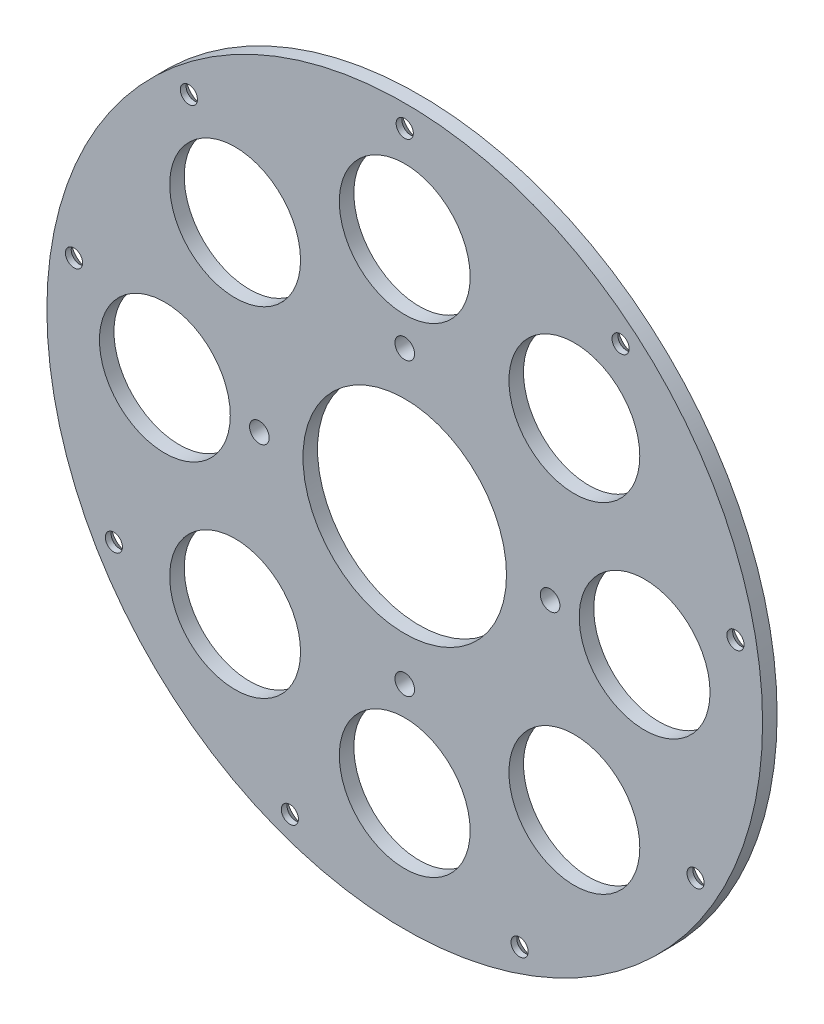
ISO-10303-21;
HEADER;
FILE_DESCRIPTION(('STEP AP214'),'2;1');
FILE_NAME('part.step','',(''),(''),'','','');
FILE_SCHEMA(('AUTOMOTIVE_DESIGN { 1 0 10303 214 1 1 1 1 }'));
ENDSEC;
DATA;
#1=APPLICATION_CONTEXT('core data for automotive mechanical design processes');
#2=APPLICATION_PROTOCOL_DEFINITION('international standard','automotive_design',2000,#1);
#3=PRODUCT_CONTEXT('',#1,'mechanical');
#4=PRODUCT('Part','Part','',(#3));
#5=PRODUCT_RELATED_PRODUCT_CATEGORY('part','',(#4));
#6=PRODUCT_DEFINITION_FORMATION('','',#4);
#7=PRODUCT_DEFINITION_CONTEXT('part definition',#1,'design');
#8=PRODUCT_DEFINITION('design','',#6,#7);
#9=PRODUCT_DEFINITION_SHAPE('','',#8);
#10=(LENGTH_UNIT() NAMED_UNIT(*) SI_UNIT(.MILLI.,.METRE.));
#11=(NAMED_UNIT(*) PLANE_ANGLE_UNIT() SI_UNIT($,.RADIAN.));
#12=(NAMED_UNIT(*) SI_UNIT($,.STERADIAN.) SOLID_ANGLE_UNIT());
#13=UNCERTAINTY_MEASURE_WITH_UNIT(LENGTH_MEASURE(1.E-05),#10,'distance_accuracy_value','');
#14=(GEOMETRIC_REPRESENTATION_CONTEXT(3) GLOBAL_UNCERTAINTY_ASSIGNED_CONTEXT((#13)) GLOBAL_UNIT_ASSIGNED_CONTEXT((#10,
#11,#12)) REPRESENTATION_CONTEXT('',''));
#15=CARTESIAN_POINT('',(0.,0.,0.));
#16=DIRECTION('',(0.,0.,1.));
#17=DIRECTION('',(1.,0.,0.));
#18=AXIS2_PLACEMENT_3D('',#15,#16,#17);
#19=CARTESIAN_POINT('',(0.,0.,5.));
#20=DIRECTION('',(0.,0.,1.));
#21=DIRECTION('',(1.,0.,0.));
#22=AXIS2_PLACEMENT_3D('',#19,#20,#21);
#23=PLANE('',#22);
#24=CARTESIAN_POINT('',(-82.4999999999965,-3.5171865420125E-12,5.));
#25=DIRECTION('',(0.,0.,1.));
#26=DIRECTION('',(1.,0.,0.));
#27=AXIS2_PLACEMENT_3D('',#24,#25,#26);
#28=CIRCLE('',#27,22.5000000000052);
#29=CARTESIAN_POINT('',(-59.9999999999913,-3.5171865420125E-12,5.));
#30=VERTEX_POINT('',#29);
#31=EDGE_CURVE('E207',#30,#30,#28,.T.);
#32=ORIENTED_EDGE('',*,*,#31,.F.);
#33=EDGE_LOOP('',(#32));
#34=FACE_BOUND('',#33,.T.);
#35=CARTESIAN_POINT('',(7.01416641183906E-12,-82.5,5.));
#36=DIRECTION('',(0.,0.,1.));
#37=DIRECTION('',(1.,0.,0.));
#38=AXIS2_PLACEMENT_3D('',#35,#36,#37);
#39=CIRCLE('',#38,22.5000000000073);
#40=CARTESIAN_POINT('',(22.5000000000143,-82.5,5.));
#41=VERTEX_POINT('',#40);
#42=EDGE_CURVE('E195',#41,#41,#39,.T.);
#43=ORIENTED_EDGE('',*,*,#42,.F.);
#44=EDGE_LOOP('',(#43));
#45=FACE_BOUND('',#44,.T.);
#46=CARTESIAN_POINT('',(3.11230459915425E-12,-50.,5.));
#47=DIRECTION('',(0.,0.,1.));
#48=DIRECTION('',(1.,0.,0.));
#49=AXIS2_PLACEMENT_3D('',#46,#47,#48);
#50=CIRCLE('',#49,3.375);
#51=CARTESIAN_POINT('',(3.37500000000311,-50.,5.));
#52=VERTEX_POINT('',#51);
#53=EDGE_CURVE('E183',#52,#52,#50,.T.);
#54=ORIENTED_EDGE('',*,*,#53,.F.);
#55=EDGE_LOOP('',(#54));
#56=FACE_BOUND('',#55,.T.);
#57=CARTESIAN_POINT('',(58.3363094478962,-58.3363094478877,5.));
#58=DIRECTION('',(0.,0.,1.));
#59=DIRECTION('',(1.,0.,0.));
#60=AXIS2_PLACEMENT_3D('',#57,#58,#59);
#61=CIRCLE('',#60,22.5000000000054);
#62=CARTESIAN_POINT('',(80.8363094479016,-58.3363094478877,5.));
#63=VERTEX_POINT('',#62);
#64=EDGE_CURVE('E171',#63,#63,#61,.T.);
#65=ORIENTED_EDGE('',*,*,#64,.F.);
#66=EDGE_LOOP('',(#65));
#67=FACE_BOUND('',#66,.T.);
#68=CARTESIAN_POINT('',(58.3363094478912,58.3363094478927,5.));
#69=DIRECTION('',(0.,0.,1.));
#70=DIRECTION('',(1.,0.,0.));
#71=AXIS2_PLACEMENT_3D('',#68,#69,#70);
#72=CIRCLE('',#71,22.5000000000004);
#73=CARTESIAN_POINT('',(80.8363094478916,58.3363094478927,5.));
#74=VERTEX_POINT('',#73);
#75=EDGE_CURVE('E159',#74,#74,#72,.T.);
#76=ORIENTED_EDGE('',*,*,#75,.F.);
#77=EDGE_LOOP('',(#76));
#78=FACE_BOUND('',#77,.T.);
#79=CARTESIAN_POINT('',(-74.2419689187942,88.4781331802388,5.));
#80=DIRECTION('',(0.,0.,1.));
#81=DIRECTION('',(1.,0.,0.));
#82=AXIS2_PLACEMENT_3D('',#79,#80,#81);
#83=CIRCLE('',#82,2.95379639516483);
#84=CARTESIAN_POINT('',(-71.2881725236293,88.4781331802388,5.));
#85=VERTEX_POINT('',#84);
#86=EDGE_CURVE('E152',#85,#85,#83,.T.);
#87=ORIENTED_EDGE('',*,*,#86,.F.);
#88=EDGE_LOOP('',(#87));
#89=FACE_BOUND('',#88,.T.);
#90=CARTESIAN_POINT('',(-100.025934137095,-57.7500000000043,5.));
#91=DIRECTION('',(0.,0.,1.));
#92=DIRECTION('',(1.,0.,0.));
#93=AXIS2_PLACEMENT_3D('',#90,#91,#92);
#94=CIRCLE('',#93,2.95379639517078);
#95=CARTESIAN_POINT('',(-97.0721377419245,-57.7500000000043,5.));
#96=VERTEX_POINT('',#95);
#97=EDGE_CURVE('E146',#96,#96,#94,.T.);
#98=ORIENTED_EDGE('',*,*,#97,.F.);
#99=EDGE_LOOP('',(#98));
#100=FACE_BOUND('',#99,.T.);
#101=CARTESIAN_POINT('',(39.5033265541243,-108.534497700771,5.));
#102=DIRECTION('',(0.,0.,1.));
#103=DIRECTION('',(1.,0.,0.));
#104=AXIS2_PLACEMENT_3D('',#101,#102,#103);
#105=CIRCLE('',#104,2.95379639517072);
#106=CARTESIAN_POINT('',(42.457122949295,-108.534497700771,5.));
#107=VERTEX_POINT('',#106);
#108=EDGE_CURVE('E140',#107,#107,#105,.T.);
#109=ORIENTED_EDGE('',*,*,#108,.F.);
#110=EDGE_LOOP('',(#109));
#111=FACE_BOUND('',#110,.T.);
#112=CARTESIAN_POINT('',(113.745295472914,20.0563645205353,5.));
#113=DIRECTION('',(0.,0.,1.));
#114=DIRECTION('',(1.,0.,0.));
#115=AXIS2_PLACEMENT_3D('',#112,#113,#114);
#116=CIRCLE('',#115,2.95379639516422);
#117=CARTESIAN_POINT('',(116.699091868078,20.0563645205353,5.));
#118=VERTEX_POINT('',#117);
#119=EDGE_CURVE('E134',#118,#118,#116,.T.);
#120=ORIENTED_EDGE('',*,*,#119,.F.);
#121=EDGE_LOOP('',(#120));
#122=FACE_BOUND('',#121,.T.);
#123=CARTESIAN_POINT('',(0.,50.,5.));
#124=DIRECTION('',(0.,0.,1.));
#125=DIRECTION('',(1.,0.,0.));
#126=AXIS2_PLACEMENT_3D('',#123,#124,#125);
#127=CIRCLE('',#126,3.375);
#128=CARTESIAN_POINT('',(3.375,50.,5.));
#129=VERTEX_POINT('',#128);
#130=EDGE_CURVE('E123',#129,#129,#127,.T.);
#131=ORIENTED_EDGE('',*,*,#130,.F.);
#132=EDGE_LOOP('',(#131));
#133=FACE_BOUND('',#132,.T.);
#134=CARTESIAN_POINT('',(0.,115.5,5.));
#135=DIRECTION('',(0.,0.,1.));
#136=DIRECTION('',(1.,0.,0.));
#137=AXIS2_PLACEMENT_3D('',#134,#135,#136);
#138=CIRCLE('',#137,2.95379639516141);
#139=CARTESIAN_POINT('',(2.95379639516141,115.5,5.));
#140=VERTEX_POINT('',#139);
#141=EDGE_CURVE('E114',#140,#140,#138,.T.);
#142=ORIENTED_EDGE('',*,*,#141,.F.);
#143=EDGE_LOOP('',(#142));
#144=FACE_BOUND('',#143,.T.);
#145=CARTESIAN_POINT('',(0.,0.,5.));
#146=DIRECTION('',(0.,0.,1.));
#147=DIRECTION('',(1.,0.,0.));
#148=AXIS2_PLACEMENT_3D('',#145,#146,#147);
#149=CIRCLE('',#148,123.074849798392);
#150=CARTESIAN_POINT('',(123.074849798392,0.,5.));
#151=VERTEX_POINT('',#150);
#152=EDGE_CURVE('E110',#151,#151,#149,.T.);
#153=ORIENTED_EDGE('',*,*,#152,.T.);
#154=EDGE_LOOP('',(#153));
#155=FACE_BOUND('',#154,.T.);
#156=CARTESIAN_POINT('',(0.,0.,5.));
#157=DIRECTION('',(0.,0.,1.));
#158=DIRECTION('',(1.,0.,0.));
#159=AXIS2_PLACEMENT_3D('',#156,#157,#158);
#160=CIRCLE('',#159,35.);
#161=CARTESIAN_POINT('',(35.,0.,5.));
#162=VERTEX_POINT('',#161);
#163=EDGE_CURVE('E119',#162,#162,#160,.T.);
#164=ORIENTED_EDGE('',*,*,#163,.F.);
#165=EDGE_LOOP('',(#164));
#166=FACE_BOUND('',#165,.T.);
#167=CARTESIAN_POINT('',(74.2419689187964,88.4781331802451,5.));
#168=DIRECTION('',(0.,0.,1.));
#169=DIRECTION('',(1.,0.,0.));
#170=AXIS2_PLACEMENT_3D('',#167,#168,#169);
#171=CIRCLE('',#170,2.95379639516176);
#172=CARTESIAN_POINT('',(77.1957653139582,88.4781331802451,5.));
#173=VERTEX_POINT('',#172);
#174=EDGE_CURVE('E129',#173,#173,#171,.T.);
#175=ORIENTED_EDGE('',*,*,#174,.F.);
#176=EDGE_LOOP('',(#175));
#177=FACE_BOUND('',#176,.T.);
#178=CARTESIAN_POINT('',(100.02593413711,-57.7499999999957,5.));
#179=DIRECTION('',(0.,0.,1.));
#180=DIRECTION('',(1.,0.,0.));
#181=AXIS2_PLACEMENT_3D('',#178,#179,#180);
#182=CIRCLE('',#181,2.95379639516774);
#183=CARTESIAN_POINT('',(102.979730532278,-57.7499999999957,5.));
#184=VERTEX_POINT('',#183);
#185=EDGE_CURVE('E137',#184,#184,#182,.T.);
#186=ORIENTED_EDGE('',*,*,#185,.F.);
#187=EDGE_LOOP('',(#186));
#188=FACE_BOUND('',#187,.T.);
#189=CARTESIAN_POINT('',(-39.5033265541052,-108.534497700774,5.));
#190=DIRECTION('',(0.,0.,1.));
#191=DIRECTION('',(1.,0.,0.));
#192=AXIS2_PLACEMENT_3D('',#189,#190,#191);
#193=CIRCLE('',#192,2.95379639517183);
#194=CARTESIAN_POINT('',(-36.5495301589334,-108.534497700774,5.));
#195=VERTEX_POINT('',#194);
#196=EDGE_CURVE('E143',#195,#195,#193,.T.);
#197=ORIENTED_EDGE('',*,*,#196,.F.);
#198=EDGE_LOOP('',(#197));
#199=FACE_BOUND('',#198,.T.);
#200=CARTESIAN_POINT('',(-113.745295472906,20.0563645205256,5.));
#201=DIRECTION('',(0.,0.,1.));
#202=DIRECTION('',(1.,0.,0.));
#203=AXIS2_PLACEMENT_3D('',#200,#201,#202);
#204=CIRCLE('',#203,2.95379639516788);
#205=CARTESIAN_POINT('',(-110.791499077738,20.0563645205256,5.));
#206=VERTEX_POINT('',#205);
#207=EDGE_CURVE('E149',#206,#206,#204,.T.);
#208=ORIENTED_EDGE('',*,*,#207,.F.);
#209=EDGE_LOOP('',(#208));
#210=FACE_BOUND('',#209,.T.);
#211=CARTESIAN_POINT('',(0.,82.5,5.));
#212=DIRECTION('',(0.,0.,1.));
#213=DIRECTION('',(1.,0.,0.));
#214=AXIS2_PLACEMENT_3D('',#211,#212,#213);
#215=CIRCLE('',#214,22.5);
#216=CARTESIAN_POINT('',(22.5,82.5,5.));
#217=VERTEX_POINT('',#216);
#218=EDGE_CURVE('E155',#217,#217,#215,.T.);
#219=ORIENTED_EDGE('',*,*,#218,.F.);
#220=EDGE_LOOP('',(#219));
#221=FACE_BOUND('',#220,.T.);
#222=CARTESIAN_POINT('',(82.5000000000035,3.50708320591953E-12,5.));
#223=DIRECTION('',(0.,0.,1.));
#224=DIRECTION('',(1.,0.,0.));
#225=AXIS2_PLACEMENT_3D('',#222,#223,#224);
#226=CIRCLE('',#225,22.5000000000026);
#227=CARTESIAN_POINT('',(105.000000000006,3.50708320591953E-12,5.));
#228=VERTEX_POINT('',#227);
#229=EDGE_CURVE('E165',#228,#228,#226,.T.);
#230=ORIENTED_EDGE('',*,*,#229,.F.);
#231=EDGE_LOOP('',(#230));
#232=FACE_BOUND('',#231,.T.);
#233=CARTESIAN_POINT('',(50.0000000000016,1.55615229957712E-12,5.));
#234=DIRECTION('',(0.,0.,1.));
#235=DIRECTION('',(1.,0.,0.));
#236=AXIS2_PLACEMENT_3D('',#233,#234,#235);
#237=CIRCLE('',#236,3.375);
#238=CARTESIAN_POINT('',(53.3750000000016,1.55615229957712E-12,5.));
#239=VERTEX_POINT('',#238);
#240=EDGE_CURVE('E177',#239,#239,#237,.T.);
#241=ORIENTED_EDGE('',*,*,#240,.F.);
#242=EDGE_LOOP('',(#241));
#243=FACE_BOUND('',#242,.T.);
#244=CARTESIAN_POINT('',(-49.9999999999985,-1.56227553357286E-12,5.));
#245=DIRECTION('',(0.,0.,1.));
#246=DIRECTION('',(1.,0.,0.));
#247=AXIS2_PLACEMENT_3D('',#244,#245,#246);
#248=CIRCLE('',#247,3.375);
#249=CARTESIAN_POINT('',(-46.6249999999984,-1.56227553357286E-12,5.));
#250=VERTEX_POINT('',#249);
#251=EDGE_CURVE('E189',#250,#250,#248,.T.);
#252=ORIENTED_EDGE('',*,*,#251,.F.);
#253=EDGE_LOOP('',(#252));
#254=FACE_BOUND('',#253,.T.);
#255=CARTESIAN_POINT('',(-58.3363094478842,-58.3363094478927,5.));
#256=DIRECTION('',(0.,0.,1.));
#257=DIRECTION('',(1.,0.,0.));
#258=AXIS2_PLACEMENT_3D('',#255,#256,#257);
#259=CIRCLE('',#258,22.5000000000071);
#260=CARTESIAN_POINT('',(-35.836309447877,-58.3363094478927,5.));
#261=VERTEX_POINT('',#260);
#262=EDGE_CURVE('E201',#261,#261,#259,.T.);
#263=ORIENTED_EDGE('',*,*,#262,.F.);
#264=EDGE_LOOP('',(#263));
#265=FACE_BOUND('',#264,.T.);
#266=CARTESIAN_POINT('',(-58.3363094478892,58.3363094478877,5.));
#267=DIRECTION('',(0.,0.,1.));
#268=DIRECTION('',(1.,0.,0.));
#269=AXIS2_PLACEMENT_3D('',#266,#267,#268);
#270=CIRCLE('',#269,22.5000000000027);
#271=CARTESIAN_POINT('',(-35.8363094478865,58.3363094478877,5.));
#272=VERTEX_POINT('',#271);
#273=EDGE_CURVE('E213',#272,#272,#270,.T.);
#274=ORIENTED_EDGE('',*,*,#273,.F.);
#275=EDGE_LOOP('',(#274));
#276=FACE_BOUND('',#275,.T.);
#277=ADVANCED_FACE('F48',(#34,#45,#56,#67,#78,#89,#100,#111,#122,#133,#144,#155,#166,#177,#188,
#199,#210,#221,#232,#243,#254,#265,#276),#23,.T.);
#278=CARTESIAN_POINT('',(0.,0.,0.));
#279=DIRECTION('',(0.,0.,1.));
#280=DIRECTION('',(1.,0.,0.));
#281=AXIS2_PLACEMENT_3D('',#278,#279,#280);
#282=PLANE('',#281);
#283=CARTESIAN_POINT('',(74.2419689187964,88.4781331802451,0.));
#284=DIRECTION('',(0.,0.,1.));
#285=DIRECTION('',(1.,0.,0.));
#286=AXIS2_PLACEMENT_3D('',#283,#284,#285);
#287=CIRCLE('',#286,5.95379639516172);
#288=CARTESIAN_POINT('',(80.1957653139581,88.4781331802451,0.));
#289=VERTEX_POINT('',#288);
#290=EDGE_CURVE('E83',#289,#289,#287,.T.);
#291=ORIENTED_EDGE('',*,*,#290,.T.);
#292=EDGE_LOOP('',(#291));
#293=FACE_BOUND('',#292,.T.);
#294=CARTESIAN_POINT('',(0.,115.5,0.));
#295=DIRECTION('',(0.,0.,1.));
#296=DIRECTION('',(1.,0.,0.));
#297=AXIS2_PLACEMENT_3D('',#294,#295,#296);
#298=CIRCLE('',#297,5.95379639516136);
#299=CARTESIAN_POINT('',(5.95379639516136,115.5,0.));
#300=VERTEX_POINT('',#299);
#301=EDGE_CURVE('E86',#300,#300,#298,.T.);
#302=ORIENTED_EDGE('',*,*,#301,.T.);
#303=EDGE_LOOP('',(#302));
#304=FACE_BOUND('',#303,.T.);
#305=CARTESIAN_POINT('',(-74.2419689187942,88.4781331802388,0.));
#306=DIRECTION('',(0.,0.,1.));
#307=DIRECTION('',(1.,0.,0.));
#308=AXIS2_PLACEMENT_3D('',#305,#306,#307);
#309=CIRCLE('',#308,5.95379639516486);
#310=CARTESIAN_POINT('',(-68.2881725236293,88.4781331802388,0.));
#311=VERTEX_POINT('',#310);
#312=EDGE_CURVE('E89',#311,#311,#309,.T.);
#313=ORIENTED_EDGE('',*,*,#312,.T.);
#314=EDGE_LOOP('',(#313));
#315=FACE_BOUND('',#314,.T.);
#316=CARTESIAN_POINT('',(-113.745295472906,20.0563645205256,0.));
#317=DIRECTION('',(0.,0.,1.));
#318=DIRECTION('',(1.,0.,0.));
#319=AXIS2_PLACEMENT_3D('',#316,#317,#318);
#320=CIRCLE('',#319,5.95379639516783);
#321=CARTESIAN_POINT('',(-107.791499077738,20.0563645205256,0.));
#322=VERTEX_POINT('',#321);
#323=EDGE_CURVE('E92',#322,#322,#320,.T.);
#324=ORIENTED_EDGE('',*,*,#323,.T.);
#325=EDGE_LOOP('',(#324));
#326=FACE_BOUND('',#325,.T.);
#327=CARTESIAN_POINT('',(-100.025934137095,-57.7500000000043,0.));
#328=DIRECTION('',(0.,0.,1.));
#329=DIRECTION('',(1.,0.,0.));
#330=AXIS2_PLACEMENT_3D('',#327,#328,#329);
#331=CIRCLE('',#330,5.95379639517082);
#332=CARTESIAN_POINT('',(-94.0721377419245,-57.7500000000043,0.));
#333=VERTEX_POINT('',#332);
#334=EDGE_CURVE('E95',#333,#333,#331,.T.);
#335=ORIENTED_EDGE('',*,*,#334,.T.);
#336=EDGE_LOOP('',(#335));
#337=FACE_BOUND('',#336,.T.);
#338=CARTESIAN_POINT('',(-39.5033265541052,-108.534497700774,0.));
#339=DIRECTION('',(0.,0.,1.));
#340=DIRECTION('',(1.,0.,0.));
#341=AXIS2_PLACEMENT_3D('',#338,#339,#340);
#342=CIRCLE('',#341,5.95379639517185);
#343=CARTESIAN_POINT('',(-33.5495301589334,-108.534497700774,0.));
#344=VERTEX_POINT('',#343);
#345=EDGE_CURVE('E98',#344,#344,#342,.T.);
#346=ORIENTED_EDGE('',*,*,#345,.T.);
#347=EDGE_LOOP('',(#346));
#348=FACE_BOUND('',#347,.T.);
#349=CARTESIAN_POINT('',(39.5033265541243,-108.534497700771,0.));
#350=DIRECTION('',(0.,0.,1.));
#351=DIRECTION('',(1.,0.,0.));
#352=AXIS2_PLACEMENT_3D('',#349,#350,#351);
#353=CIRCLE('',#352,5.95379639517066);
#354=CARTESIAN_POINT('',(45.4571229492949,-108.534497700771,0.));
#355=VERTEX_POINT('',#354);
#356=EDGE_CURVE('E101',#355,#355,#353,.T.);
#357=ORIENTED_EDGE('',*,*,#356,.T.);
#358=EDGE_LOOP('',(#357));
#359=FACE_BOUND('',#358,.T.);
#360=CARTESIAN_POINT('',(100.02593413711,-57.7499999999957,0.));
#361=DIRECTION('',(0.,0.,1.));
#362=DIRECTION('',(1.,0.,0.));
#363=AXIS2_PLACEMENT_3D('',#360,#361,#362);
#364=CIRCLE('',#363,5.95379639516769);
#365=CARTESIAN_POINT('',(105.979730532278,-57.7499999999957,0.));
#366=VERTEX_POINT('',#365);
#367=EDGE_CURVE('E104',#366,#366,#364,.T.);
#368=ORIENTED_EDGE('',*,*,#367,.T.);
#369=EDGE_LOOP('',(#368));
#370=FACE_BOUND('',#369,.T.);
#371=CARTESIAN_POINT('',(113.745295472914,20.0563645205353,0.));
#372=DIRECTION('',(0.,0.,1.));
#373=DIRECTION('',(1.,0.,0.));
#374=AXIS2_PLACEMENT_3D('',#371,#372,#373);
#375=CIRCLE('',#374,5.95379639516425);
#376=CARTESIAN_POINT('',(119.699091868078,20.0563645205353,0.));
#377=VERTEX_POINT('',#376);
#378=EDGE_CURVE('E107',#377,#377,#375,.T.);
#379=ORIENTED_EDGE('',*,*,#378,.T.);
#380=EDGE_LOOP('',(#379));
#381=FACE_BOUND('',#380,.T.);
#382=CARTESIAN_POINT('',(0.,0.,0.));
#383=DIRECTION('',(0.,0.,1.));
#384=DIRECTION('',(1.,0.,0.));
#385=AXIS2_PLACEMENT_3D('',#382,#383,#384);
#386=CIRCLE('',#385,123.074849798392);
#387=CARTESIAN_POINT('',(123.074849798392,0.,0.));
#388=VERTEX_POINT('',#387);
#389=EDGE_CURVE('E111',#388,#388,#386,.T.);
#390=ORIENTED_EDGE('',*,*,#389,.F.);
#391=EDGE_LOOP('',(#390));
#392=FACE_BOUND('',#391,.T.);
#393=CARTESIAN_POINT('',(0.,0.,0.));
#394=DIRECTION('',(0.,0.,1.));
#395=DIRECTION('',(1.,0.,0.));
#396=AXIS2_PLACEMENT_3D('',#393,#394,#395);
#397=CIRCLE('',#396,35.);
#398=CARTESIAN_POINT('',(35.,0.,0.));
#399=VERTEX_POINT('',#398);
#400=EDGE_CURVE('E120',#399,#399,#397,.T.);
#401=ORIENTED_EDGE('',*,*,#400,.T.);
#402=EDGE_LOOP('',(#401));
#403=FACE_BOUND('',#402,.T.);
#404=CARTESIAN_POINT('',(0.,50.,0.));
#405=DIRECTION('',(0.,0.,1.));
#406=DIRECTION('',(1.,0.,0.));
#407=AXIS2_PLACEMENT_3D('',#404,#405,#406);
#408=CIRCLE('',#407,3.375);
#409=CARTESIAN_POINT('',(3.375,50.,0.));
#410=VERTEX_POINT('',#409);
#411=EDGE_CURVE('E126',#410,#410,#408,.T.);
#412=ORIENTED_EDGE('',*,*,#411,.T.);
#413=EDGE_LOOP('',(#412));
#414=FACE_BOUND('',#413,.T.);
#415=CARTESIAN_POINT('',(0.,82.5,0.));
#416=DIRECTION('',(0.,0.,1.));
#417=DIRECTION('',(1.,0.,0.));
#418=AXIS2_PLACEMENT_3D('',#415,#416,#417);
#419=CIRCLE('',#418,22.5);
#420=CARTESIAN_POINT('',(22.5,82.5,0.));
#421=VERTEX_POINT('',#420);
#422=EDGE_CURVE('E156',#421,#421,#419,.T.);
#423=ORIENTED_EDGE('',*,*,#422,.T.);
#424=EDGE_LOOP('',(#423));
#425=FACE_BOUND('',#424,.T.);
#426=CARTESIAN_POINT('',(58.3363094478912,58.3363094478927,0.));
#427=DIRECTION('',(0.,0.,1.));
#428=DIRECTION('',(1.,0.,0.));
#429=AXIS2_PLACEMENT_3D('',#426,#427,#428);
#430=CIRCLE('',#429,22.5000000000004);
#431=CARTESIAN_POINT('',(80.8363094478916,58.3363094478927,0.));
#432=VERTEX_POINT('',#431);
#433=EDGE_CURVE('E162',#432,#432,#430,.T.);
#434=ORIENTED_EDGE('',*,*,#433,.T.);
#435=EDGE_LOOP('',(#434));
#436=FACE_BOUND('',#435,.T.);
#437=CARTESIAN_POINT('',(82.5000000000035,3.50708320591953E-12,0.));
#438=DIRECTION('',(0.,0.,1.));
#439=DIRECTION('',(1.,0.,0.));
#440=AXIS2_PLACEMENT_3D('',#437,#438,#439);
#441=CIRCLE('',#440,22.5000000000026);
#442=CARTESIAN_POINT('',(105.000000000006,3.50708320591953E-12,0.));
#443=VERTEX_POINT('',#442);
#444=EDGE_CURVE('E168',#443,#443,#441,.T.);
#445=ORIENTED_EDGE('',*,*,#444,.T.);
#446=EDGE_LOOP('',(#445));
#447=FACE_BOUND('',#446,.T.);
#448=CARTESIAN_POINT('',(58.3363094478962,-58.3363094478877,0.));
#449=DIRECTION('',(0.,0.,1.));
#450=DIRECTION('',(1.,0.,0.));
#451=AXIS2_PLACEMENT_3D('',#448,#449,#450);
#452=CIRCLE('',#451,22.5000000000054);
#453=CARTESIAN_POINT('',(80.8363094479016,-58.3363094478877,0.));
#454=VERTEX_POINT('',#453);
#455=EDGE_CURVE('E174',#454,#454,#452,.T.);
#456=ORIENTED_EDGE('',*,*,#455,.T.);
#457=EDGE_LOOP('',(#456));
#458=FACE_BOUND('',#457,.T.);
#459=CARTESIAN_POINT('',(50.0000000000016,1.55615229957712E-12,0.));
#460=DIRECTION('',(0.,0.,1.));
#461=DIRECTION('',(1.,0.,0.));
#462=AXIS2_PLACEMENT_3D('',#459,#460,#461);
#463=CIRCLE('',#462,3.375);
#464=CARTESIAN_POINT('',(53.3750000000016,1.55615229957712E-12,0.));
#465=VERTEX_POINT('',#464);
#466=EDGE_CURVE('E180',#465,#465,#463,.T.);
#467=ORIENTED_EDGE('',*,*,#466,.T.);
#468=EDGE_LOOP('',(#467));
#469=FACE_BOUND('',#468,.T.);
#470=CARTESIAN_POINT('',(3.11230459915425E-12,-50.,0.));
#471=DIRECTION('',(0.,0.,1.));
#472=DIRECTION('',(1.,0.,0.));
#473=AXIS2_PLACEMENT_3D('',#470,#471,#472);
#474=CIRCLE('',#473,3.375);
#475=CARTESIAN_POINT('',(3.37500000000311,-50.,0.));
#476=VERTEX_POINT('',#475);
#477=EDGE_CURVE('E186',#476,#476,#474,.T.);
#478=ORIENTED_EDGE('',*,*,#477,.T.);
#479=EDGE_LOOP('',(#478));
#480=FACE_BOUND('',#479,.T.);
#481=CARTESIAN_POINT('',(-49.9999999999985,-1.56227553357286E-12,0.));
#482=DIRECTION('',(0.,0.,1.));
#483=DIRECTION('',(1.,0.,0.));
#484=AXIS2_PLACEMENT_3D('',#481,#482,#483);
#485=CIRCLE('',#484,3.375);
#486=CARTESIAN_POINT('',(-46.6249999999984,-1.56227553357286E-12,0.));
#487=VERTEX_POINT('',#486);
#488=EDGE_CURVE('E192',#487,#487,#485,.T.);
#489=ORIENTED_EDGE('',*,*,#488,.T.);
#490=EDGE_LOOP('',(#489));
#491=FACE_BOUND('',#490,.T.);
#492=CARTESIAN_POINT('',(7.01416641183906E-12,-82.5,0.));
#493=DIRECTION('',(0.,0.,1.));
#494=DIRECTION('',(1.,0.,0.));
#495=AXIS2_PLACEMENT_3D('',#492,#493,#494);
#496=CIRCLE('',#495,22.5000000000073);
#497=CARTESIAN_POINT('',(22.5000000000143,-82.5,0.));
#498=VERTEX_POINT('',#497);
#499=EDGE_CURVE('E198',#498,#498,#496,.T.);
#500=ORIENTED_EDGE('',*,*,#499,.T.);
#501=EDGE_LOOP('',(#500));
#502=FACE_BOUND('',#501,.T.);
#503=CARTESIAN_POINT('',(-58.3363094478842,-58.3363094478927,0.));
#504=DIRECTION('',(0.,0.,1.));
#505=DIRECTION('',(1.,0.,0.));
#506=AXIS2_PLACEMENT_3D('',#503,#504,#505);
#507=CIRCLE('',#506,22.5000000000071);
#508=CARTESIAN_POINT('',(-35.836309447877,-58.3363094478927,0.));
#509=VERTEX_POINT('',#508);
#510=EDGE_CURVE('E204',#509,#509,#507,.T.);
#511=ORIENTED_EDGE('',*,*,#510,.T.);
#512=EDGE_LOOP('',(#511));
#513=FACE_BOUND('',#512,.T.);
#514=CARTESIAN_POINT('',(-82.4999999999965,-3.5171865420125E-12,0.));
#515=DIRECTION('',(0.,0.,1.));
#516=DIRECTION('',(1.,0.,0.));
#517=AXIS2_PLACEMENT_3D('',#514,#515,#516);
#518=CIRCLE('',#517,22.5000000000052);
#519=CARTESIAN_POINT('',(-59.9999999999913,-3.5171865420125E-12,0.));
#520=VERTEX_POINT('',#519);
#521=EDGE_CURVE('E210',#520,#520,#518,.T.);
#522=ORIENTED_EDGE('',*,*,#521,.T.);
#523=EDGE_LOOP('',(#522));
#524=FACE_BOUND('',#523,.T.);
#525=CARTESIAN_POINT('',(-58.3363094478892,58.3363094478877,0.));
#526=DIRECTION('',(0.,0.,1.));
#527=DIRECTION('',(1.,0.,0.));
#528=AXIS2_PLACEMENT_3D('',#525,#526,#527);
#529=CIRCLE('',#528,22.5000000000027);
#530=CARTESIAN_POINT('',(-35.8363094478865,58.3363094478877,0.));
#531=VERTEX_POINT('',#530);
#532=EDGE_CURVE('E216',#531,#531,#529,.T.);
#533=ORIENTED_EDGE('',*,*,#532,.T.);
#534=EDGE_LOOP('',(#533));
#535=FACE_BOUND('',#534,.T.);
#536=ADVANCED_FACE('F226',(#293,#304,#315,#326,#337,#348,#359,#370,#381,#392,#403,#414,#425,
#436,#447,#458,#469,#480,#491,#502,#513,#524,#535),#282,.F.);
#537=CARTESIAN_POINT('',(0.,0.,5.));
#538=DIRECTION('',(0.,0.,-1.));
#539=DIRECTION('',(-1.,0.,0.));
#540=AXIS2_PLACEMENT_3D('',#537,#538,#539);
#541=CYLINDRICAL_SURFACE('',#540,123.074849798392);
#542=ORIENTED_EDGE('',*,*,#152,.F.);
#543=EDGE_LOOP('',(#542));
#544=FACE_BOUND('',#543,.T.);
#545=ORIENTED_EDGE('',*,*,#389,.T.);
#546=EDGE_LOOP('',(#545));
#547=FACE_BOUND('',#546,.T.);
#548=ADVANCED_FACE('F232',(#544,#547),#541,.T.);
#549=CARTESIAN_POINT('',(0.,115.5,5.));
#550=DIRECTION('',(0.,0.,-1.));
#551=DIRECTION('',(-1.,0.,0.));
#552=AXIS2_PLACEMENT_3D('',#549,#550,#551);
#553=CYLINDRICAL_SURFACE('',#552,2.95379639516141);
#554=CARTESIAN_POINT('',(0.,115.5,2.99999999999996));
#555=DIRECTION('',(0.,0.,1.));
#556=DIRECTION('',(1.,0.,0.));
#557=AXIS2_PLACEMENT_3D('',#554,#555,#556);
#558=CIRCLE('',#557,2.95379639516141);
#559=CARTESIAN_POINT('',(2.95379639516141,115.5,2.99999999999996));
#560=VERTEX_POINT('',#559);
#561=EDGE_CURVE('E77',#560,#560,#558,.F.);
#562=ORIENTED_EDGE('',*,*,#561,.T.);
#563=EDGE_LOOP('',(#562));
#564=FACE_BOUND('',#563,.T.);
#565=ORIENTED_EDGE('',*,*,#141,.T.);
#566=EDGE_LOOP('',(#565));
#567=FACE_BOUND('',#566,.T.);
#568=ADVANCED_FACE('F238',(#564,#567),#553,.F.);
#569=CARTESIAN_POINT('',(0.,0.,5.));
#570=DIRECTION('',(0.,0.,-1.));
#571=DIRECTION('',(-1.,0.,0.));
#572=AXIS2_PLACEMENT_3D('',#569,#570,#571);
#573=CYLINDRICAL_SURFACE('',#572,35.);
#574=ORIENTED_EDGE('',*,*,#163,.T.);
#575=EDGE_LOOP('',(#574));
#576=FACE_BOUND('',#575,.T.);
#577=ORIENTED_EDGE('',*,*,#400,.F.);
#578=EDGE_LOOP('',(#577));
#579=FACE_BOUND('',#578,.T.);
#580=ADVANCED_FACE('F388',(#576,#579),#573,.F.);
#581=CARTESIAN_POINT('',(0.,50.,5.));
#582=DIRECTION('',(0.,0.,-1.));
#583=DIRECTION('',(-1.,0.,0.));
#584=AXIS2_PLACEMENT_3D('',#581,#582,#583);
#585=CYLINDRICAL_SURFACE('',#584,3.375);
#586=ORIENTED_EDGE('',*,*,#130,.T.);
#587=EDGE_LOOP('',(#586));
#588=FACE_BOUND('',#587,.T.);
#589=ORIENTED_EDGE('',*,*,#411,.F.);
#590=EDGE_LOOP('',(#589));
#591=FACE_BOUND('',#590,.T.);
#592=ADVANCED_FACE('F385',(#588,#591),#585,.F.);
#593=CARTESIAN_POINT('',(74.2419689187964,88.4781331802451,5.));
#594=DIRECTION('',(0.,0.,-1.));
#595=DIRECTION('',(-1.,0.,0.));
#596=AXIS2_PLACEMENT_3D('',#593,#594,#595);
#597=CYLINDRICAL_SURFACE('',#596,2.95379639516176);
#598=CARTESIAN_POINT('',(74.2419689187964,88.4781331802451,2.99999999999997));
#599=DIRECTION('',(0.,0.,1.));
#600=DIRECTION('',(1.,0.,0.));
#601=AXIS2_PLACEMENT_3D('',#598,#599,#600);
#602=CIRCLE('',#601,2.95379639516176);
#603=CARTESIAN_POINT('',(77.1957653139582,88.4781331802451,2.99999999999997));
#604=VERTEX_POINT('',#603);
#605=EDGE_CURVE('E80',#604,#604,#602,.F.);
#606=ORIENTED_EDGE('',*,*,#605,.T.);
#607=EDGE_LOOP('',(#606));
#608=FACE_BOUND('',#607,.T.);
#609=ORIENTED_EDGE('',*,*,#174,.T.);
#610=EDGE_LOOP('',(#609));
#611=FACE_BOUND('',#610,.T.);
#612=ADVANCED_FACE('F382',(#608,#611),#597,.F.);
#613=CARTESIAN_POINT('',(113.745295472914,20.0563645205353,5.));
#614=DIRECTION('',(0.,0.,-1.));
#615=DIRECTION('',(-1.,0.,0.));
#616=AXIS2_PLACEMENT_3D('',#613,#614,#615);
#617=CYLINDRICAL_SURFACE('',#616,2.95379639516422);
#618=CARTESIAN_POINT('',(113.745295472914,20.0563645205353,3.00000000000003));
#619=DIRECTION('',(0.,0.,1.));
#620=DIRECTION('',(1.,0.,0.));
#621=AXIS2_PLACEMENT_3D('',#618,#619,#620);
#622=CIRCLE('',#621,2.95379639516422);
#623=CARTESIAN_POINT('',(116.699091868078,20.0563645205353,3.00000000000003));
#624=VERTEX_POINT('',#623);
#625=EDGE_CURVE('E12',#624,#624,#622,.F.);
#626=ORIENTED_EDGE('',*,*,#625,.T.);
#627=EDGE_LOOP('',(#626));
#628=FACE_BOUND('',#627,.T.);
#629=ORIENTED_EDGE('',*,*,#119,.T.);
#630=EDGE_LOOP('',(#629));
#631=FACE_BOUND('',#630,.T.);
#632=ADVANCED_FACE('F379',(#628,#631),#617,.F.);
#633=CARTESIAN_POINT('',(100.02593413711,-57.7499999999957,5.));
#634=DIRECTION('',(0.,0.,-1.));
#635=DIRECTION('',(-1.,0.,0.));
#636=AXIS2_PLACEMENT_3D('',#633,#634,#635);
#637=CYLINDRICAL_SURFACE('',#636,2.95379639516774);
#638=CARTESIAN_POINT('',(100.02593413711,-57.7499999999957,2.99999999999996));
#639=DIRECTION('',(0.,0.,1.));
#640=DIRECTION('',(1.,0.,0.));
#641=AXIS2_PLACEMENT_3D('',#638,#639,#640);
#642=CIRCLE('',#641,2.95379639516774);
#643=CARTESIAN_POINT('',(102.979730532278,-57.7499999999957,2.99999999999996));
#644=VERTEX_POINT('',#643);
#645=EDGE_CURVE('E55',#644,#644,#642,.F.);
#646=ORIENTED_EDGE('',*,*,#645,.T.);
#647=EDGE_LOOP('',(#646));
#648=FACE_BOUND('',#647,.T.);
#649=ORIENTED_EDGE('',*,*,#185,.T.);
#650=EDGE_LOOP('',(#649));
#651=FACE_BOUND('',#650,.T.);
#652=ADVANCED_FACE('F375',(#648,#651),#637,.F.);
#653=CARTESIAN_POINT('',(39.5033265541243,-108.534497700771,5.));
#654=DIRECTION('',(0.,0.,-1.));
#655=DIRECTION('',(-1.,0.,0.));
#656=AXIS2_PLACEMENT_3D('',#653,#654,#655);
#657=CYLINDRICAL_SURFACE('',#656,2.95379639517072);
#658=CARTESIAN_POINT('',(39.5033265541243,-108.534497700771,2.99999999999998));
#659=DIRECTION('',(0.,0.,1.));
#660=DIRECTION('',(1.,0.,0.));
#661=AXIS2_PLACEMENT_3D('',#658,#659,#660);
#662=CIRCLE('',#661,2.95379639517072);
#663=CARTESIAN_POINT('',(42.457122949295,-108.534497700771,2.99999999999998));
#664=VERTEX_POINT('',#663);
#665=EDGE_CURVE('E59',#664,#664,#662,.F.);
#666=ORIENTED_EDGE('',*,*,#665,.T.);
#667=EDGE_LOOP('',(#666));
#668=FACE_BOUND('',#667,.T.);
#669=ORIENTED_EDGE('',*,*,#108,.T.);
#670=EDGE_LOOP('',(#669));
#671=FACE_BOUND('',#670,.T.);
#672=ADVANCED_FACE('F371',(#668,#671),#657,.F.);
#673=CARTESIAN_POINT('',(-39.5033265541052,-108.534497700774,5.));
#674=DIRECTION('',(0.,0.,-1.));
#675=DIRECTION('',(-1.,0.,0.));
#676=AXIS2_PLACEMENT_3D('',#673,#674,#675);
#677=CYLINDRICAL_SURFACE('',#676,2.95379639517183);
#678=CARTESIAN_POINT('',(-39.5033265541052,-108.534497700774,3.00000000000003));
#679=DIRECTION('',(0.,0.,1.));
#680=DIRECTION('',(1.,0.,0.));
#681=AXIS2_PLACEMENT_3D('',#678,#679,#680);
#682=CIRCLE('',#681,2.95379639517183);
#683=CARTESIAN_POINT('',(-36.5495301589334,-108.534497700774,3.00000000000003));
#684=VERTEX_POINT('',#683);
#685=EDGE_CURVE('E63',#684,#684,#682,.F.);
#686=ORIENTED_EDGE('',*,*,#685,.T.);
#687=EDGE_LOOP('',(#686));
#688=FACE_BOUND('',#687,.T.);
#689=ORIENTED_EDGE('',*,*,#196,.T.);
#690=EDGE_LOOP('',(#689));
#691=FACE_BOUND('',#690,.T.);
#692=ADVANCED_FACE('F367',(#688,#691),#677,.F.);
#693=CARTESIAN_POINT('',(-100.025934137095,-57.7500000000043,5.));
#694=DIRECTION('',(0.,0.,-1.));
#695=DIRECTION('',(-1.,0.,0.));
#696=AXIS2_PLACEMENT_3D('',#693,#694,#695);
#697=CYLINDRICAL_SURFACE('',#696,2.95379639517078);
#698=CARTESIAN_POINT('',(-100.025934137095,-57.7500000000043,3.00000000000006));
#699=DIRECTION('',(0.,0.,1.));
#700=DIRECTION('',(1.,0.,0.));
#701=AXIS2_PLACEMENT_3D('',#698,#699,#700);
#702=CIRCLE('',#701,2.95379639517078);
#703=CARTESIAN_POINT('',(-97.0721377419245,-57.7500000000043,3.00000000000006));
#704=VERTEX_POINT('',#703);
#705=EDGE_CURVE('E68',#704,#704,#702,.F.);
#706=ORIENTED_EDGE('',*,*,#705,.T.);
#707=EDGE_LOOP('',(#706));
#708=FACE_BOUND('',#707,.T.);
#709=ORIENTED_EDGE('',*,*,#97,.T.);
#710=EDGE_LOOP('',(#709));
#711=FACE_BOUND('',#710,.T.);
#712=ADVANCED_FACE('F363',(#708,#711),#697,.F.);
#713=CARTESIAN_POINT('',(-113.745295472906,20.0563645205256,5.));
#714=DIRECTION('',(0.,0.,-1.));
#715=DIRECTION('',(-1.,0.,0.));
#716=AXIS2_PLACEMENT_3D('',#713,#714,#715);
#717=CYLINDRICAL_SURFACE('',#716,2.95379639516788);
#718=CARTESIAN_POINT('',(-113.745295472906,20.0563645205256,2.99999999999999));
#719=DIRECTION('',(0.,0.,1.));
#720=DIRECTION('',(1.,0.,0.));
#721=AXIS2_PLACEMENT_3D('',#718,#719,#720);
#722=CIRCLE('',#721,2.95379639516788);
#723=CARTESIAN_POINT('',(-110.791499077738,20.0563645205256,2.99999999999999));
#724=VERTEX_POINT('',#723);
#725=EDGE_CURVE('E71',#724,#724,#722,.F.);
#726=ORIENTED_EDGE('',*,*,#725,.T.);
#727=EDGE_LOOP('',(#726));
#728=FACE_BOUND('',#727,.T.);
#729=ORIENTED_EDGE('',*,*,#207,.T.);
#730=EDGE_LOOP('',(#729));
#731=FACE_BOUND('',#730,.T.);
#732=ADVANCED_FACE('F359',(#728,#731),#717,.F.);
#733=CARTESIAN_POINT('',(-74.2419689187942,88.4781331802388,5.));
#734=DIRECTION('',(0.,0.,-1.));
#735=DIRECTION('',(-1.,0.,0.));
#736=AXIS2_PLACEMENT_3D('',#733,#734,#735);
#737=CYLINDRICAL_SURFACE('',#736,2.95379639516483);
#738=CARTESIAN_POINT('',(-74.2419689187942,88.4781331802388,3.00000000000004));
#739=DIRECTION('',(0.,0.,1.));
#740=DIRECTION('',(1.,0.,0.));
#741=AXIS2_PLACEMENT_3D('',#738,#739,#740);
#742=CIRCLE('',#741,2.95379639516483);
#743=CARTESIAN_POINT('',(-71.2881725236293,88.4781331802388,3.00000000000004));
#744=VERTEX_POINT('',#743);
#745=EDGE_CURVE('E74',#744,#744,#742,.F.);
#746=ORIENTED_EDGE('',*,*,#745,.T.);
#747=EDGE_LOOP('',(#746));
#748=FACE_BOUND('',#747,.T.);
#749=ORIENTED_EDGE('',*,*,#86,.T.);
#750=EDGE_LOOP('',(#749));
#751=FACE_BOUND('',#750,.T.);
#752=ADVANCED_FACE('F355',(#748,#751),#737,.F.);
#753=CARTESIAN_POINT('',(0.,82.5,5.));
#754=DIRECTION('',(0.,0.,-1.));
#755=DIRECTION('',(-1.,0.,0.));
#756=AXIS2_PLACEMENT_3D('',#753,#754,#755);
#757=CYLINDRICAL_SURFACE('',#756,22.5);
#758=ORIENTED_EDGE('',*,*,#218,.T.);
#759=EDGE_LOOP('',(#758));
#760=FACE_BOUND('',#759,.T.);
#761=ORIENTED_EDGE('',*,*,#422,.F.);
#762=EDGE_LOOP('',(#761));
#763=FACE_BOUND('',#762,.T.);
#764=ADVANCED_FACE('F351',(#760,#763),#757,.F.);
#765=CARTESIAN_POINT('',(58.3363094478912,58.3363094478927,5.));
#766=DIRECTION('',(0.,0.,-1.));
#767=DIRECTION('',(-1.,0.,0.));
#768=AXIS2_PLACEMENT_3D('',#765,#766,#767);
#769=CYLINDRICAL_SURFACE('',#768,22.5000000000004);
#770=ORIENTED_EDGE('',*,*,#75,.T.);
#771=EDGE_LOOP('',(#770));
#772=FACE_BOUND('',#771,.T.);
#773=ORIENTED_EDGE('',*,*,#433,.F.);
#774=EDGE_LOOP('',(#773));
#775=FACE_BOUND('',#774,.T.);
#776=ADVANCED_FACE('F347',(#772,#775),#769,.F.);
#777=CARTESIAN_POINT('',(82.5000000000035,3.50708320591953E-12,5.));
#778=DIRECTION('',(0.,0.,-1.));
#779=DIRECTION('',(-1.,0.,0.));
#780=AXIS2_PLACEMENT_3D('',#777,#778,#779);
#781=CYLINDRICAL_SURFACE('',#780,22.5000000000026);
#782=ORIENTED_EDGE('',*,*,#229,.T.);
#783=EDGE_LOOP('',(#782));
#784=FACE_BOUND('',#783,.T.);
#785=ORIENTED_EDGE('',*,*,#444,.F.);
#786=EDGE_LOOP('',(#785));
#787=FACE_BOUND('',#786,.T.);
#788=ADVANCED_FACE('F343',(#784,#787),#781,.F.);
#789=CARTESIAN_POINT('',(58.3363094478962,-58.3363094478877,5.));
#790=DIRECTION('',(0.,0.,-1.));
#791=DIRECTION('',(-1.,0.,0.));
#792=AXIS2_PLACEMENT_3D('',#789,#790,#791);
#793=CYLINDRICAL_SURFACE('',#792,22.5000000000054);
#794=ORIENTED_EDGE('',*,*,#64,.T.);
#795=EDGE_LOOP('',(#794));
#796=FACE_BOUND('',#795,.T.);
#797=ORIENTED_EDGE('',*,*,#455,.F.);
#798=EDGE_LOOP('',(#797));
#799=FACE_BOUND('',#798,.T.);
#800=ADVANCED_FACE('F339',(#796,#799),#793,.F.);
#801=CARTESIAN_POINT('',(50.0000000000016,1.55615229957712E-12,5.));
#802=DIRECTION('',(0.,0.,-1.));
#803=DIRECTION('',(-1.,0.,0.));
#804=AXIS2_PLACEMENT_3D('',#801,#802,#803);
#805=CYLINDRICAL_SURFACE('',#804,3.375);
#806=ORIENTED_EDGE('',*,*,#240,.T.);
#807=EDGE_LOOP('',(#806));
#808=FACE_BOUND('',#807,.T.);
#809=ORIENTED_EDGE('',*,*,#466,.F.);
#810=EDGE_LOOP('',(#809));
#811=FACE_BOUND('',#810,.T.);
#812=ADVANCED_FACE('F335',(#808,#811),#805,.F.);
#813=CARTESIAN_POINT('',(3.11230459915425E-12,-50.,5.));
#814=DIRECTION('',(0.,0.,-1.));
#815=DIRECTION('',(-1.,0.,0.));
#816=AXIS2_PLACEMENT_3D('',#813,#814,#815);
#817=CYLINDRICAL_SURFACE('',#816,3.375);
#818=ORIENTED_EDGE('',*,*,#53,.T.);
#819=EDGE_LOOP('',(#818));
#820=FACE_BOUND('',#819,.T.);
#821=ORIENTED_EDGE('',*,*,#477,.F.);
#822=EDGE_LOOP('',(#821));
#823=FACE_BOUND('',#822,.T.);
#824=ADVANCED_FACE('F331',(#820,#823),#817,.F.);
#825=CARTESIAN_POINT('',(-49.9999999999985,-1.56227553357286E-12,5.));
#826=DIRECTION('',(0.,0.,-1.));
#827=DIRECTION('',(-1.,0.,0.));
#828=AXIS2_PLACEMENT_3D('',#825,#826,#827);
#829=CYLINDRICAL_SURFACE('',#828,3.375);
#830=ORIENTED_EDGE('',*,*,#251,.T.);
#831=EDGE_LOOP('',(#830));
#832=FACE_BOUND('',#831,.T.);
#833=ORIENTED_EDGE('',*,*,#488,.F.);
#834=EDGE_LOOP('',(#833));
#835=FACE_BOUND('',#834,.T.);
#836=ADVANCED_FACE('F327',(#832,#835),#829,.F.);
#837=CARTESIAN_POINT('',(7.01416641183906E-12,-82.5,5.));
#838=DIRECTION('',(0.,0.,-1.));
#839=DIRECTION('',(-1.,0.,0.));
#840=AXIS2_PLACEMENT_3D('',#837,#838,#839);
#841=CYLINDRICAL_SURFACE('',#840,22.5000000000073);
#842=ORIENTED_EDGE('',*,*,#42,.T.);
#843=EDGE_LOOP('',(#842));
#844=FACE_BOUND('',#843,.T.);
#845=ORIENTED_EDGE('',*,*,#499,.F.);
#846=EDGE_LOOP('',(#845));
#847=FACE_BOUND('',#846,.T.);
#848=ADVANCED_FACE('F323',(#844,#847),#841,.F.);
#849=CARTESIAN_POINT('',(-58.3363094478842,-58.3363094478927,5.));
#850=DIRECTION('',(0.,0.,-1.));
#851=DIRECTION('',(-1.,0.,0.));
#852=AXIS2_PLACEMENT_3D('',#849,#850,#851);
#853=CYLINDRICAL_SURFACE('',#852,22.5000000000071);
#854=ORIENTED_EDGE('',*,*,#262,.T.);
#855=EDGE_LOOP('',(#854));
#856=FACE_BOUND('',#855,.T.);
#857=ORIENTED_EDGE('',*,*,#510,.F.);
#858=EDGE_LOOP('',(#857));
#859=FACE_BOUND('',#858,.T.);
#860=ADVANCED_FACE('F317',(#856,#859),#853,.F.);
#861=CARTESIAN_POINT('',(-82.4999999999965,-3.5171865420125E-12,5.));
#862=DIRECTION('',(0.,0.,-1.));
#863=DIRECTION('',(-1.,0.,0.));
#864=AXIS2_PLACEMENT_3D('',#861,#862,#863);
#865=CYLINDRICAL_SURFACE('',#864,22.5000000000052);
#866=ORIENTED_EDGE('',*,*,#31,.T.);
#867=EDGE_LOOP('',(#866));
#868=FACE_BOUND('',#867,.T.);
#869=ORIENTED_EDGE('',*,*,#521,.F.);
#870=EDGE_LOOP('',(#869));
#871=FACE_BOUND('',#870,.T.);
#872=ADVANCED_FACE('F312',(#868,#871),#865,.F.);
#873=CARTESIAN_POINT('',(-58.3363094478892,58.3363094478877,5.));
#874=DIRECTION('',(0.,0.,-1.));
#875=DIRECTION('',(-1.,0.,0.));
#876=AXIS2_PLACEMENT_3D('',#873,#874,#875);
#877=CYLINDRICAL_SURFACE('',#876,22.5000000000027);
#878=ORIENTED_EDGE('',*,*,#273,.T.);
#879=EDGE_LOOP('',(#878));
#880=FACE_BOUND('',#879,.T.);
#881=ORIENTED_EDGE('',*,*,#532,.F.);
#882=EDGE_LOOP('',(#881));
#883=FACE_BOUND('',#882,.T.);
#884=ADVANCED_FACE('F222',(#880,#883),#877,.F.);
#885=CARTESIAN_POINT('',(74.2419689187964,88.4781331802451,0.));
#886=DIRECTION('',(0.,0.,-1.));
#887=DIRECTION('',(-1.,0.,0.));
#888=AXIS2_PLACEMENT_3D('',#885,#886,#887);
#889=CONICAL_SURFACE('',#888,5.95379639516172,0.785398163397446);
#890=ORIENTED_EDGE('',*,*,#605,.F.);
#891=EDGE_LOOP('',(#890));
#892=FACE_BOUND('',#891,.T.);
#893=ORIENTED_EDGE('',*,*,#290,.F.);
#894=EDGE_LOOP('',(#893));
#895=FACE_BOUND('',#894,.T.);
#896=ADVANCED_FACE('F244',(#892,#895),#889,.F.);
#897=CARTESIAN_POINT('',(0.,115.5,0.));
#898=DIRECTION('',(0.,0.,-1.));
#899=DIRECTION('',(-1.,0.,0.));
#900=AXIS2_PLACEMENT_3D('',#897,#898,#899);
#901=CONICAL_SURFACE('',#900,5.95379639516136,0.785398163397445);
#902=ORIENTED_EDGE('',*,*,#561,.F.);
#903=EDGE_LOOP('',(#902));
#904=FACE_BOUND('',#903,.T.);
#905=ORIENTED_EDGE('',*,*,#301,.F.);
#906=EDGE_LOOP('',(#905));
#907=FACE_BOUND('',#906,.T.);
#908=ADVANCED_FACE('F247',(#904,#907),#901,.F.);
#909=CARTESIAN_POINT('',(-74.2419689187942,88.4781331802388,0.));
#910=DIRECTION('',(0.,0.,-1.));
#911=DIRECTION('',(-1.,0.,0.));
#912=AXIS2_PLACEMENT_3D('',#909,#910,#911);
#913=CONICAL_SURFACE('',#912,5.95379639516486,0.785398163397446);
#914=ORIENTED_EDGE('',*,*,#745,.F.);
#915=EDGE_LOOP('',(#914));
#916=FACE_BOUND('',#915,.T.);
#917=ORIENTED_EDGE('',*,*,#312,.F.);
#918=EDGE_LOOP('',(#917));
#919=FACE_BOUND('',#918,.T.);
#920=ADVANCED_FACE('F251',(#916,#919),#913,.F.);
#921=CARTESIAN_POINT('',(-113.745295472906,20.0563645205256,0.));
#922=DIRECTION('',(0.,0.,-1.));
#923=DIRECTION('',(-1.,0.,0.));
#924=AXIS2_PLACEMENT_3D('',#921,#922,#923);
#925=CONICAL_SURFACE('',#924,5.95379639516783,0.785398163397442);
#926=ORIENTED_EDGE('',*,*,#725,.F.);
#927=EDGE_LOOP('',(#926));
#928=FACE_BOUND('',#927,.T.);
#929=ORIENTED_EDGE('',*,*,#323,.F.);
#930=EDGE_LOOP('',(#929));
#931=FACE_BOUND('',#930,.T.);
#932=ADVANCED_FACE('F255',(#928,#931),#925,.F.);
#933=CARTESIAN_POINT('',(-100.025934137095,-57.7500000000043,0.));
#934=DIRECTION('',(0.,0.,-1.));
#935=DIRECTION('',(-1.,0.,0.));
#936=AXIS2_PLACEMENT_3D('',#933,#934,#935);
#937=CONICAL_SURFACE('',#936,5.95379639517082,0.785398163397447);
#938=ORIENTED_EDGE('',*,*,#705,.F.);
#939=EDGE_LOOP('',(#938));
#940=FACE_BOUND('',#939,.T.);
#941=ORIENTED_EDGE('',*,*,#334,.F.);
#942=EDGE_LOOP('',(#941));
#943=FACE_BOUND('',#942,.T.);
#944=ADVANCED_FACE('F259',(#940,#943),#937,.F.);
#945=CARTESIAN_POINT('',(-39.5033265541052,-108.534497700774,0.));
#946=DIRECTION('',(0.,0.,-1.));
#947=DIRECTION('',(-1.,0.,0.));
#948=AXIS2_PLACEMENT_3D('',#945,#946,#947);
#949=CONICAL_SURFACE('',#948,5.95379639517185,0.785398163397447);
#950=ORIENTED_EDGE('',*,*,#685,.F.);
#951=EDGE_LOOP('',(#950));
#952=FACE_BOUND('',#951,.T.);
#953=ORIENTED_EDGE('',*,*,#345,.F.);
#954=EDGE_LOOP('',(#953));
#955=FACE_BOUND('',#954,.T.);
#956=ADVANCED_FACE('F263',(#952,#955),#949,.F.);
#957=CARTESIAN_POINT('',(39.5033265541243,-108.534497700771,0.));
#958=DIRECTION('',(0.,0.,-1.));
#959=DIRECTION('',(-1.,0.,0.));
#960=AXIS2_PLACEMENT_3D('',#957,#958,#959);
#961=CONICAL_SURFACE('',#960,5.95379639517066,0.785398163397442);
#962=ORIENTED_EDGE('',*,*,#665,.F.);
#963=EDGE_LOOP('',(#962));
#964=FACE_BOUND('',#963,.T.);
#965=ORIENTED_EDGE('',*,*,#356,.F.);
#966=EDGE_LOOP('',(#965));
#967=FACE_BOUND('',#966,.T.);
#968=ADVANCED_FACE('F267',(#964,#967),#961,.F.);
#969=CARTESIAN_POINT('',(100.02593413711,-57.7499999999957,0.));
#970=DIRECTION('',(0.,0.,-1.));
#971=DIRECTION('',(-1.,0.,0.));
#972=AXIS2_PLACEMENT_3D('',#969,#970,#971);
#973=CONICAL_SURFACE('',#972,5.95379639516769,0.785398163397446);
#974=ORIENTED_EDGE('',*,*,#645,.F.);
#975=EDGE_LOOP('',(#974));
#976=FACE_BOUND('',#975,.T.);
#977=ORIENTED_EDGE('',*,*,#367,.F.);
#978=EDGE_LOOP('',(#977));
#979=FACE_BOUND('',#978,.T.);
#980=ADVANCED_FACE('F270',(#976,#979),#973,.F.);
#981=CARTESIAN_POINT('',(113.745295472914,20.0563645205353,0.));
#982=DIRECTION('',(0.,0.,-1.));
#983=DIRECTION('',(-1.,0.,0.));
#984=AXIS2_PLACEMENT_3D('',#981,#982,#983);
#985=CONICAL_SURFACE('',#984,5.95379639516425,0.785398163397447);
#986=ORIENTED_EDGE('',*,*,#625,.F.);
#987=EDGE_LOOP('',(#986));
#988=FACE_BOUND('',#987,.T.);
#989=ORIENTED_EDGE('',*,*,#378,.F.);
#990=EDGE_LOOP('',(#989));
#991=FACE_BOUND('',#990,.T.);
#992=ADVANCED_FACE('F50',(#988,#991),#985,.F.);
#993=CLOSED_SHELL('',(#277,#536,#548,#568,#580,#592,#612,#632,#652,#672,#692,#712,#732,#752,
#764,#776,#788,#800,#812,#824,#836,#848,#860,#872,#884,#896,#908,#920,#932,#944,#956,#968,#980,#992));
#994=MANIFOLD_SOLID_BREP('B2',#993);
#995=ADVANCED_BREP_SHAPE_REPRESENTATION('',(#18,#994),#14);
#996=SHAPE_DEFINITION_REPRESENTATION(#9,#995);
ENDSEC;
END-ISO-10303-21;
